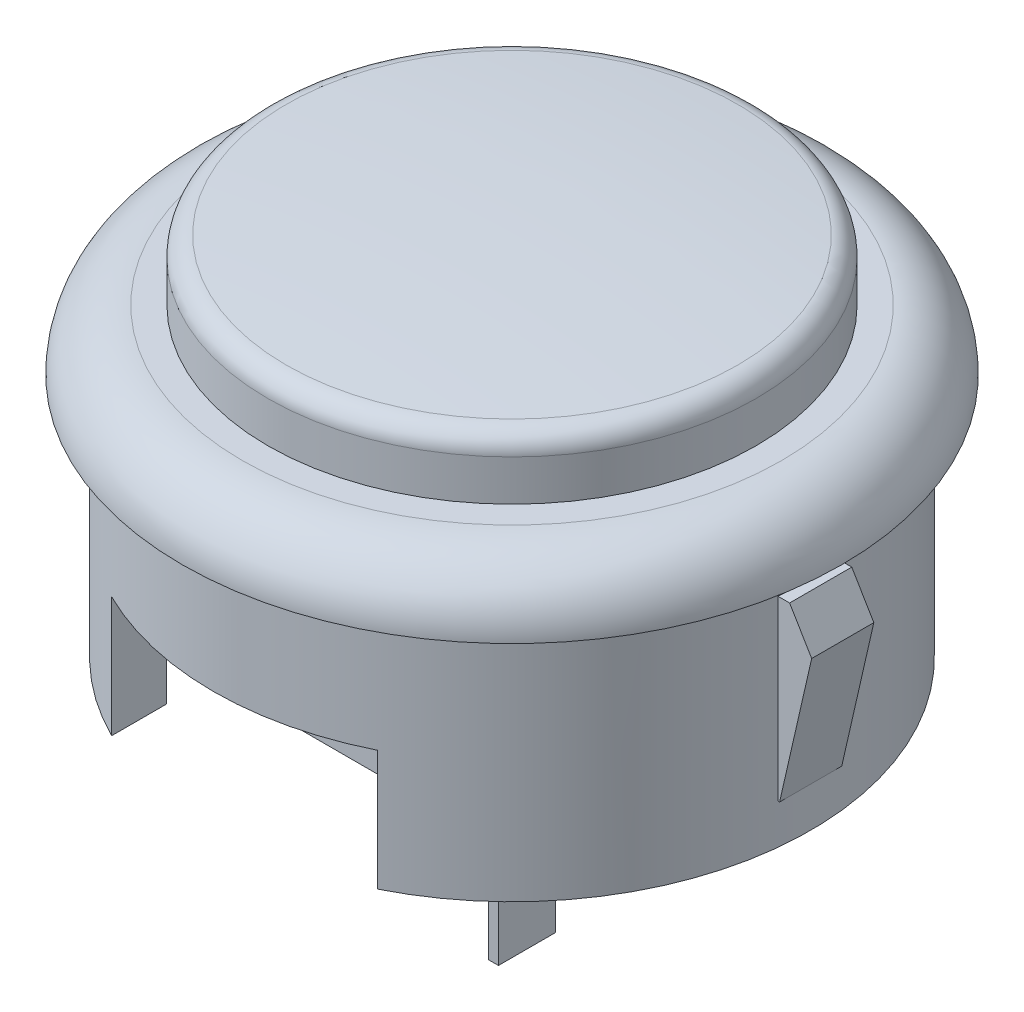
ISO-10303-21;
HEADER;
FILE_DESCRIPTION(('STEP AP214'),'2;1');
FILE_NAME('part.step','',(''),(''),'','','');
FILE_SCHEMA(('AUTOMOTIVE_DESIGN { 1 0 10303 214 1 1 1 1 }'));
ENDSEC;
DATA;
#1=APPLICATION_CONTEXT('core data for automotive mechanical design processes');
#2=APPLICATION_PROTOCOL_DEFINITION('international standard','automotive_design',2000,#1);
#3=PRODUCT_CONTEXT('',#1,'mechanical');
#4=PRODUCT('Part','Part','',(#3));
#5=PRODUCT_RELATED_PRODUCT_CATEGORY('part','',(#4));
#6=PRODUCT_DEFINITION_FORMATION('','',#4);
#7=PRODUCT_DEFINITION_CONTEXT('part definition',#1,'design');
#8=PRODUCT_DEFINITION('design','',#6,#7);
#9=PRODUCT_DEFINITION_SHAPE('','',#8);
#10=(LENGTH_UNIT() NAMED_UNIT(*) SI_UNIT(.MILLI.,.METRE.));
#11=(NAMED_UNIT(*) PLANE_ANGLE_UNIT() SI_UNIT($,.RADIAN.));
#12=(NAMED_UNIT(*) SI_UNIT($,.STERADIAN.) SOLID_ANGLE_UNIT());
#13=UNCERTAINTY_MEASURE_WITH_UNIT(LENGTH_MEASURE(1.E-05),#10,'distance_accuracy_value','');
#14=(GEOMETRIC_REPRESENTATION_CONTEXT(3) GLOBAL_UNCERTAINTY_ASSIGNED_CONTEXT((#13)) GLOBAL_UNIT_ASSIGNED_CONTEXT((#10,
#11,#12)) REPRESENTATION_CONTEXT('',''));
#15=CARTESIAN_POINT('',(0.,0.,0.));
#16=DIRECTION('',(0.,0.,1.));
#17=DIRECTION('',(1.,0.,0.));
#18=AXIS2_PLACEMENT_3D('',#15,#16,#17);
#19=CARTESIAN_POINT('',(0.,-14.25,0.));
#20=DIRECTION('',(0.,1.,0.));
#21=DIRECTION('',(0.,0.,1.));
#22=AXIS2_PLACEMENT_3D('',#19,#20,#21);
#23=PLANE('',#22);
#24=DIRECTION('',(0.,0.,-1.));
#25=VECTOR('',#24,1.);
#26=CARTESIAN_POINT('',(2.2,-14.25,3.375));
#27=LINE('',#26,#25);
#28=CARTESIAN_POINT('',(2.2,-14.25,3.375));
#29=VERTEX_POINT('',#28);
#30=CARTESIAN_POINT('',(2.2,-14.25,0.524999999999999));
#31=VERTEX_POINT('',#30);
#32=EDGE_CURVE('E268',#29,#31,#27,.T.);
#33=ORIENTED_EDGE('',*,*,#32,.F.);
#34=DIRECTION('',(-1.,0.,0.));
#35=VECTOR('',#34,1.);
#36=CARTESIAN_POINT('',(2.2,-14.25,3.375));
#37=LINE('',#36,#35);
#38=CARTESIAN_POINT('',(2.7,-14.25,3.375));
#39=VERTEX_POINT('',#38);
#40=EDGE_CURVE('E281',#39,#29,#37,.T.);
#41=ORIENTED_EDGE('',*,*,#40,.F.);
#42=DIRECTION('',(0.,0.,1.));
#43=VECTOR('',#42,1.);
#44=CARTESIAN_POINT('',(2.7,-14.25,3.375));
#45=LINE('',#44,#43);
#46=CARTESIAN_POINT('',(2.7,-14.25,0.524999999999999));
#47=VERTEX_POINT('',#46);
#48=EDGE_CURVE('E290',#47,#39,#45,.T.);
#49=ORIENTED_EDGE('',*,*,#48,.F.);
#50=DIRECTION('',(1.,0.,0.));
#51=VECTOR('',#50,1.);
#52=CARTESIAN_POINT('',(2.2,-14.25,0.524999999999999));
#53=LINE('',#52,#51);
#54=EDGE_CURVE('E271',#31,#47,#53,.T.);
#55=ORIENTED_EDGE('',*,*,#54,.F.);
#56=EDGE_LOOP('',(#33,#41,#49,#55));
#57=FACE_BOUND('',#56,.T.);
#58=DIRECTION('',(0.,0.,1.));
#59=VECTOR('',#58,1.);
#60=CARTESIAN_POINT('',(6.,-14.25,-6.375));
#61=LINE('',#60,#59);
#62=CARTESIAN_POINT('',(6.,-14.25,-6.375));
#63=VERTEX_POINT('',#62);
#64=CARTESIAN_POINT('',(6.,-14.25,6.375));
#65=VERTEX_POINT('',#64);
#66=EDGE_CURVE('E307',#63,#65,#61,.T.);
#67=ORIENTED_EDGE('',*,*,#66,.T.);
#68=DIRECTION('',(-1.,0.,0.));
#69=VECTOR('',#68,1.);
#70=CARTESIAN_POINT('',(-6.,-14.25,6.375));
#71=LINE('',#70,#69);
#72=CARTESIAN_POINT('',(-6.,-14.25,6.375));
#73=VERTEX_POINT('',#72);
#74=EDGE_CURVE('E310',#65,#73,#71,.T.);
#75=ORIENTED_EDGE('',*,*,#74,.T.);
#76=DIRECTION('',(0.,0.,-1.));
#77=VECTOR('',#76,1.);
#78=CARTESIAN_POINT('',(-6.,-14.25,-6.375));
#79=LINE('',#78,#77);
#80=CARTESIAN_POINT('',(-6.,-14.25,-6.375));
#81=VERTEX_POINT('',#80);
#82=EDGE_CURVE('E313',#73,#81,#79,.T.);
#83=ORIENTED_EDGE('',*,*,#82,.T.);
#84=DIRECTION('',(1.,0.,0.));
#85=VECTOR('',#84,1.);
#86=CARTESIAN_POINT('',(-6.,-14.25,-6.375));
#87=LINE('',#86,#85);
#88=EDGE_CURVE('E315',#81,#63,#87,.T.);
#89=ORIENTED_EDGE('',*,*,#88,.T.);
#90=EDGE_LOOP('',(#67,#75,#83,#89));
#91=FACE_BOUND('',#90,.T.);
#92=DIRECTION('',(0.,0.,-1.));
#93=VECTOR('',#92,1.);
#94=CARTESIAN_POINT('',(-2.7,-14.25,-0.525));
#95=LINE('',#94,#93);
#96=CARTESIAN_POINT('',(-2.7,-14.25,-0.525));
#97=VERTEX_POINT('',#96);
#98=CARTESIAN_POINT('',(-2.7,-14.25,-3.375));
#99=VERTEX_POINT('',#98);
#100=EDGE_CURVE('E267',#97,#99,#95,.T.);
#101=ORIENTED_EDGE('',*,*,#100,.F.);
#102=DIRECTION('',(-1.,0.,0.));
#103=VECTOR('',#102,1.);
#104=CARTESIAN_POINT('',(-2.7,-14.25,-0.525));
#105=LINE('',#104,#103);
#106=CARTESIAN_POINT('',(-2.2,-14.25,-0.525));
#107=VERTEX_POINT('',#106);
#108=EDGE_CURVE('E264',#107,#97,#105,.T.);
#109=ORIENTED_EDGE('',*,*,#108,.F.);
#110=DIRECTION('',(0.,0.,1.));
#111=VECTOR('',#110,1.);
#112=CARTESIAN_POINT('',(-2.2,-14.25,-0.525));
#113=LINE('',#112,#111);
#114=CARTESIAN_POINT('',(-2.2,-14.25,-3.375));
#115=VERTEX_POINT('',#114);
#116=EDGE_CURVE('E63',#115,#107,#113,.T.);
#117=ORIENTED_EDGE('',*,*,#116,.F.);
#118=DIRECTION('',(1.,0.,0.));
#119=VECTOR('',#118,1.);
#120=CARTESIAN_POINT('',(-2.7,-14.25,-3.375));
#121=LINE('',#120,#119);
#122=EDGE_CURVE('E58',#99,#115,#121,.T.);
#123=ORIENTED_EDGE('',*,*,#122,.F.);
#124=EDGE_LOOP('',(#101,#109,#117,#123));
#125=FACE_BOUND('',#124,.T.);
#126=ADVANCED_FACE('F43',(#57,#91,#125),#23,.F.);
#127=CARTESIAN_POINT('',(12.5,-6.25,0.));
#128=DIRECTION('',(0.,1.,0.));
#129=DIRECTION('',(0.,0.,1.));
#130=AXIS2_PLACEMENT_3D('',#127,#128,#129);
#131=PLANE('',#130);
#132=CARTESIAN_POINT('',(0.,-6.25,0.));
#133=DIRECTION('',(0.,1.,0.));
#134=DIRECTION('',(0.,0.,1.));
#135=AXIS2_PLACEMENT_3D('',#132,#133,#134);
#136=CIRCLE('',#135,12.5);
#137=CARTESIAN_POINT('',(6.62499999999999,-6.25,10.5999705188269));
#138=VERTEX_POINT('',#137);
#139=CARTESIAN_POINT('',(6.62499999999999,-6.25,-10.5999705188269));
#140=VERTEX_POINT('',#139);
#141=EDGE_CURVE('E459',#138,#140,#136,.T.);
#142=ORIENTED_EDGE('',*,*,#141,.F.);
#143=DIRECTION('',(0.,0.,1.));
#144=VECTOR('',#143,1.);
#145=CARTESIAN_POINT('',(6.62499999999999,-6.25,-16.45));
#146=LINE('',#145,#144);
#147=CARTESIAN_POINT('',(6.62499999999999,-6.25,13.3461370815678));
#148=VERTEX_POINT('',#147);
#149=EDGE_CURVE('E409',#138,#148,#146,.T.);
#150=ORIENTED_EDGE('',*,*,#149,.T.);
#151=CARTESIAN_POINT('',(0.,-6.25,0.));
#152=DIRECTION('',(0.,1.,0.));
#153=DIRECTION('',(-1.,0.,0.));
#154=AXIS2_PLACEMENT_3D('',#151,#152,#153);
#155=CIRCLE('',#154,14.9);
#156=CARTESIAN_POINT('',(-6.62500000000001,-6.25,13.3461370815678));
#157=VERTEX_POINT('',#156);
#158=EDGE_CURVE('E445',#157,#148,#155,.T.);
#159=ORIENTED_EDGE('',*,*,#158,.F.);
#160=DIRECTION('',(0.,0.,1.));
#161=VECTOR('',#160,1.);
#162=CARTESIAN_POINT('',(-6.62500000000001,-6.25,-16.45));
#163=LINE('',#162,#161);
#164=CARTESIAN_POINT('',(-6.62500000000001,-6.25,10.5999705188269));
#165=VERTEX_POINT('',#164);
#166=EDGE_CURVE('E404',#165,#157,#163,.T.);
#167=ORIENTED_EDGE('',*,*,#166,.F.);
#168=CARTESIAN_POINT('',(-6.62500000000001,-6.25,-10.5999705188269));
#169=VERTEX_POINT('',#168);
#170=EDGE_CURVE('E458',#169,#165,#136,.T.);
#171=ORIENTED_EDGE('',*,*,#170,.F.);
#172=CARTESIAN_POINT('',(-6.62500000000001,-6.25,-13.3461370815678));
#173=VERTEX_POINT('',#172);
#174=EDGE_CURVE('E407',#173,#169,#163,.T.);
#175=ORIENTED_EDGE('',*,*,#174,.F.);
#176=CARTESIAN_POINT('',(6.62499999999999,-6.25,-13.3461370815678));
#177=VERTEX_POINT('',#176);
#178=EDGE_CURVE('E442',#177,#173,#155,.T.);
#179=ORIENTED_EDGE('',*,*,#178,.F.);
#180=EDGE_CURVE('E408',#177,#140,#146,.T.);
#181=ORIENTED_EDGE('',*,*,#180,.T.);
#182=EDGE_LOOP('',(#142,#150,#159,#167,#171,#175,#179,#181));
#183=FACE_BOUND('',#182,.T.);
#184=DIRECTION('',(0.,0.,1.));
#185=VECTOR('',#184,1.);
#186=CARTESIAN_POINT('',(6.,-6.25,-6.375));
#187=LINE('',#186,#185);
#188=CARTESIAN_POINT('',(6.,-6.25,-6.375));
#189=VERTEX_POINT('',#188);
#190=CARTESIAN_POINT('',(6.,-6.25,6.375));
#191=VERTEX_POINT('',#190);
#192=EDGE_CURVE('E306',#189,#191,#187,.T.);
#193=ORIENTED_EDGE('',*,*,#192,.F.);
#194=DIRECTION('',(1.,0.,0.));
#195=VECTOR('',#194,1.);
#196=CARTESIAN_POINT('',(-6.,-6.25,-6.375));
#197=LINE('',#196,#195);
#198=CARTESIAN_POINT('',(-6.,-6.25,-6.375));
#199=VERTEX_POINT('',#198);
#200=EDGE_CURVE('E311',#199,#189,#197,.T.);
#201=ORIENTED_EDGE('',*,*,#200,.F.);
#202=DIRECTION('',(0.,0.,-1.));
#203=VECTOR('',#202,1.);
#204=CARTESIAN_POINT('',(-6.,-6.25,-6.375));
#205=LINE('',#204,#203);
#206=CARTESIAN_POINT('',(-6.,-6.25,6.375));
#207=VERTEX_POINT('',#206);
#208=EDGE_CURVE('E323',#207,#199,#205,.T.);
#209=ORIENTED_EDGE('',*,*,#208,.F.);
#210=DIRECTION('',(-1.,0.,0.));
#211=VECTOR('',#210,1.);
#212=CARTESIAN_POINT('',(-6.,-6.25,6.375));
#213=LINE('',#212,#211);
#214=EDGE_CURVE('E320',#191,#207,#213,.T.);
#215=ORIENTED_EDGE('',*,*,#214,.F.);
#216=EDGE_LOOP('',(#193,#201,#209,#215));
#217=FACE_BOUND('',#216,.T.);
#218=ADVANCED_FACE('F533',(#183,#217),#131,.F.);
#219=CARTESIAN_POINT('',(0.,7.97104395334219,0.));
#220=DIRECTION('',(0.,1.,0.));
#221=DIRECTION('',(0.,0.,1.));
#222=AXIS2_PLACEMENT_3D('',#219,#220,#221);
#223=CYLINDRICAL_SURFACE('',#222,14.9);
#224=DIRECTION('',(0.,1.,0.));
#225=VECTOR('',#224,1.);
#226=CARTESIAN_POINT('',(14.8191598952167,7.97104395334219,1.55));
#227=LINE('',#226,#225);
#228=CARTESIAN_POINT('',(14.8191598952167,-1.4,1.55));
#229=VERTEX_POINT('',#228);
#230=CARTESIAN_POINT('',(14.8191598952167,-10.25,1.55));
#231=VERTEX_POINT('',#230);
#232=EDGE_CURVE('E485',#229,#231,#227,.F.);
#233=ORIENTED_EDGE('',*,*,#232,.F.);
#234=CARTESIAN_POINT('',(0.,-1.4,0.));
#235=DIRECTION('',(0.,-1.,0.));
#236=DIRECTION('',(0.,0.,-1.));
#237=AXIS2_PLACEMENT_3D('',#234,#235,#236);
#238=CIRCLE('',#237,14.9);
#239=CARTESIAN_POINT('',(14.8191598952167,-1.4,-1.55));
#240=VERTEX_POINT('',#239);
#241=EDGE_CURVE('E479',#240,#229,#238,.T.);
#242=ORIENTED_EDGE('',*,*,#241,.F.);
#243=DIRECTION('',(0.,1.,0.));
#244=VECTOR('',#243,1.);
#245=CARTESIAN_POINT('',(14.8191598952167,7.97104395334219,-1.55));
#246=LINE('',#245,#244);
#247=CARTESIAN_POINT('',(14.8191598952167,-10.25,-1.55));
#248=VERTEX_POINT('',#247);
#249=EDGE_CURVE('E476',#240,#248,#246,.F.);
#250=ORIENTED_EDGE('',*,*,#249,.T.);
#251=CARTESIAN_POINT('',(0.,-10.25,0.));
#252=DIRECTION('',(0.,1.,0.));
#253=DIRECTION('',(0.,0.,1.));
#254=AXIS2_PLACEMENT_3D('',#251,#252,#253);
#255=CIRCLE('',#254,14.9);
#256=CARTESIAN_POINT('',(14.9,-10.25,0.));
#257=VERTEX_POINT('',#256);
#258=EDGE_CURVE('E481',#257,#248,#255,.T.);
#259=ORIENTED_EDGE('',*,*,#258,.F.);
#260=EDGE_CURVE('E484',#231,#257,#255,.T.);
#261=ORIENTED_EDGE('',*,*,#260,.F.);
#262=EDGE_LOOP('',(#233,#242,#250,#259,#261));
#263=FACE_BOUND('',#262,.T.);
#264=CARTESIAN_POINT('',(0.,0.,0.));
#265=DIRECTION('',(0.,1.,0.));
#266=DIRECTION('',(0.,0.,1.));
#267=AXIS2_PLACEMENT_3D('',#264,#265,#266);
#268=CIRCLE('',#267,14.9);
#269=CARTESIAN_POINT('',(0.,0.,14.9));
#270=VERTEX_POINT('',#269);
#271=EDGE_CURVE('E470',#270,#270,#268,.T.);
#272=ORIENTED_EDGE('',*,*,#271,.F.);
#273=EDGE_LOOP('',(#272));
#274=FACE_BOUND('',#273,.T.);
#275=ORIENTED_EDGE('',*,*,#178,.T.);
#276=DIRECTION('',(0.,1.,0.));
#277=VECTOR('',#276,1.);
#278=CARTESIAN_POINT('',(-6.62500000000001,7.97104395334219,-13.3461370815678));
#279=LINE('',#278,#277);
#280=CARTESIAN_POINT('',(-6.62500000000001,-12.25,-13.3461370815678));
#281=VERTEX_POINT('',#280);
#282=EDGE_CURVE('E436',#173,#281,#279,.F.);
#283=ORIENTED_EDGE('',*,*,#282,.T.);
#284=CARTESIAN_POINT('',(0.,-12.25,0.));
#285=DIRECTION('',(0.,1.,0.));
#286=DIRECTION('',(0.,0.,1.));
#287=AXIS2_PLACEMENT_3D('',#284,#285,#286);
#288=CIRCLE('',#287,14.9);
#289=CARTESIAN_POINT('',(-6.62500000000001,-12.25,13.3461370815678));
#290=VERTEX_POINT('',#289);
#291=EDGE_CURVE('E466',#281,#290,#288,.T.);
#292=ORIENTED_EDGE('',*,*,#291,.T.);
#293=DIRECTION('',(0.,1.,0.));
#294=VECTOR('',#293,1.);
#295=CARTESIAN_POINT('',(-6.62500000000001,7.97104395334219,13.3461370815678));
#296=LINE('',#295,#294);
#297=EDGE_CURVE('E439',#290,#157,#296,.T.);
#298=ORIENTED_EDGE('',*,*,#297,.T.);
#299=ORIENTED_EDGE('',*,*,#158,.T.);
#300=DIRECTION('',(0.,1.,0.));
#301=VECTOR('',#300,1.);
#302=CARTESIAN_POINT('',(6.62499999999999,7.97104395334219,13.3461370815678));
#303=LINE('',#302,#301);
#304=CARTESIAN_POINT('',(6.62499999999999,-12.25,13.3461370815678));
#305=VERTEX_POINT('',#304);
#306=EDGE_CURVE('E424',#148,#305,#303,.F.);
#307=ORIENTED_EDGE('',*,*,#306,.T.);
#308=CARTESIAN_POINT('',(6.62499999999999,-12.25,-13.3461370815678));
#309=VERTEX_POINT('',#308);
#310=EDGE_CURVE('E467',#305,#309,#288,.T.);
#311=ORIENTED_EDGE('',*,*,#310,.T.);
#312=DIRECTION('',(0.,1.,0.));
#313=VECTOR('',#312,1.);
#314=CARTESIAN_POINT('',(6.62499999999999,7.97104395334219,-13.3461370815678));
#315=LINE('',#314,#313);
#316=EDGE_CURVE('E427',#309,#177,#315,.T.);
#317=ORIENTED_EDGE('',*,*,#316,.T.);
#318=EDGE_LOOP('',(#275,#283,#292,#298,#299,#307,#311,#317));
#319=FACE_BOUND('',#318,.T.);
#320=DIRECTION('',(0.,1.,0.));
#321=VECTOR('',#320,1.);
#322=CARTESIAN_POINT('',(-14.8191598952167,7.97104395334219,1.55));
#323=LINE('',#322,#321);
#324=CARTESIAN_POINT('',(-14.8191598952167,-10.25,1.55));
#325=VERTEX_POINT('',#324);
#326=CARTESIAN_POINT('',(-14.8191598952167,-1.4,1.55));
#327=VERTEX_POINT('',#326);
#328=EDGE_CURVE('E11',#325,#327,#323,.T.);
#329=ORIENTED_EDGE('',*,*,#328,.F.);
#330=CARTESIAN_POINT('',(0.,-10.25,0.));
#331=DIRECTION('',(0.,-1.,0.));
#332=DIRECTION('',(0.,0.,-1.));
#333=AXIS2_PLACEMENT_3D('',#330,#331,#332);
#334=CIRCLE('',#333,14.9);
#335=CARTESIAN_POINT('',(-14.9,-10.25,0.));
#336=VERTEX_POINT('',#335);
#337=EDGE_CURVE('E51',#325,#336,#334,.T.);
#338=ORIENTED_EDGE('',*,*,#337,.T.);
#339=CARTESIAN_POINT('',(-14.8191598952167,-10.25,-1.55));
#340=VERTEX_POINT('',#339);
#341=EDGE_CURVE('E492',#336,#340,#334,.T.);
#342=ORIENTED_EDGE('',*,*,#341,.T.);
#343=DIRECTION('',(0.,1.,0.));
#344=VECTOR('',#343,1.);
#345=CARTESIAN_POINT('',(-14.8191598952167,7.97104395334219,-1.55));
#346=LINE('',#345,#344);
#347=CARTESIAN_POINT('',(-14.8191598952167,-1.4,-1.55));
#348=VERTEX_POINT('',#347);
#349=EDGE_CURVE('E487',#340,#348,#346,.T.);
#350=ORIENTED_EDGE('',*,*,#349,.T.);
#351=CARTESIAN_POINT('',(0.,-1.4,0.));
#352=DIRECTION('',(0.,1.,0.));
#353=DIRECTION('',(0.,0.,1.));
#354=AXIS2_PLACEMENT_3D('',#351,#352,#353);
#355=CIRCLE('',#354,14.9);
#356=EDGE_CURVE('E490',#348,#327,#355,.T.);
#357=ORIENTED_EDGE('',*,*,#356,.T.);
#358=EDGE_LOOP('',(#329,#338,#342,#350,#357));
#359=FACE_BOUND('',#358,.T.);
#360=ADVANCED_FACE('F497',(#263,#274,#319,#359),#223,.T.);
#361=CARTESIAN_POINT('',(14.9,-12.25,0.));
#362=DIRECTION('',(0.,1.,0.));
#363=DIRECTION('',(0.,0.,1.));
#364=AXIS2_PLACEMENT_3D('',#361,#362,#363);
#365=PLANE('',#364);
#366=ORIENTED_EDGE('',*,*,#291,.F.);
#367=DIRECTION('',(0.,0.,1.));
#368=VECTOR('',#367,1.);
#369=CARTESIAN_POINT('',(-6.62500000000001,-12.25,-16.45));
#370=LINE('',#369,#368);
#371=CARTESIAN_POINT('',(-6.62500000000001,-12.25,-10.5999705188269));
#372=VERTEX_POINT('',#371);
#373=EDGE_CURVE('E415',#281,#372,#370,.T.);
#374=ORIENTED_EDGE('',*,*,#373,.T.);
#375=CARTESIAN_POINT('',(0.,-12.25,0.));
#376=DIRECTION('',(0.,1.,0.));
#377=DIRECTION('',(0.,0.,1.));
#378=AXIS2_PLACEMENT_3D('',#375,#376,#377);
#379=CIRCLE('',#378,12.5);
#380=CARTESIAN_POINT('',(-6.62500000000001,-12.25,10.5999705188269));
#381=VERTEX_POINT('',#380);
#382=EDGE_CURVE('E462',#372,#381,#379,.T.);
#383=ORIENTED_EDGE('',*,*,#382,.T.);
#384=EDGE_CURVE('E403',#381,#290,#370,.T.);
#385=ORIENTED_EDGE('',*,*,#384,.T.);
#386=EDGE_LOOP('',(#366,#374,#383,#385));
#387=FACE_BOUND('',#386,.T.);
#388=ADVANCED_FACE('F632',(#387),#365,.F.);
#389=CARTESIAN_POINT('',(0.,7.97104395334219,0.));
#390=DIRECTION('',(0.,1.,0.));
#391=DIRECTION('',(0.,0.,1.));
#392=AXIS2_PLACEMENT_3D('',#389,#390,#391);
#393=CYLINDRICAL_SURFACE('',#392,12.5);
#394=ORIENTED_EDGE('',*,*,#170,.T.);
#395=DIRECTION('',(0.,1.,0.));
#396=VECTOR('',#395,1.);
#397=CARTESIAN_POINT('',(-6.62500000000001,7.97104395334219,10.5999705188269));
#398=LINE('',#397,#396);
#399=EDGE_CURVE('E433',#165,#381,#398,.F.);
#400=ORIENTED_EDGE('',*,*,#399,.T.);
#401=ORIENTED_EDGE('',*,*,#382,.F.);
#402=DIRECTION('',(0.,1.,0.));
#403=VECTOR('',#402,1.);
#404=CARTESIAN_POINT('',(-6.62500000000001,7.97104395334219,-10.5999705188269));
#405=LINE('',#404,#403);
#406=EDGE_CURVE('E430',#372,#169,#405,.T.);
#407=ORIENTED_EDGE('',*,*,#406,.T.);
#408=EDGE_LOOP('',(#394,#400,#401,#407));
#409=FACE_BOUND('',#408,.T.);
#410=ADVANCED_FACE('F627',(#409),#393,.F.);
#411=CARTESIAN_POINT('',(0.,0.,0.));
#412=DIRECTION('',(0.,1.,0.));
#413=DIRECTION('',(0.,0.,1.));
#414=AXIS2_PLACEMENT_3D('',#411,#412,#413);
#415=TOROIDAL_SURFACE('',#414,13.45,3.);
#416=CARTESIAN_POINT('',(0.,3.,0.));
#417=DIRECTION('',(0.,1.,0.));
#418=DIRECTION('',(0.,0.,1.));
#419=AXIS2_PLACEMENT_3D('',#416,#417,#418);
#420=CIRCLE('',#419,13.45);
#421=CARTESIAN_POINT('',(0.,3.,13.45));
#422=VERTEX_POINT('',#421);
#423=EDGE_CURVE('E446',#422,#422,#420,.T.);
#424=ORIENTED_EDGE('',*,*,#423,.F.);
#425=EDGE_LOOP('',(#424));
#426=FACE_BOUND('',#425,.T.);
#427=CARTESIAN_POINT('',(0.,0.,0.));
#428=DIRECTION('',(0.,1.,0.));
#429=DIRECTION('',(0.,0.,1.));
#430=AXIS2_PLACEMENT_3D('',#427,#428,#429);
#431=CIRCLE('',#430,16.45);
#432=CARTESIAN_POINT('',(0.,0.,16.45));
#433=VERTEX_POINT('',#432);
#434=EDGE_CURVE('E473',#433,#433,#431,.T.);
#435=ORIENTED_EDGE('',*,*,#434,.T.);
#436=EDGE_LOOP('',(#435));
#437=FACE_BOUND('',#436,.T.);
#438=ADVANCED_FACE('F45',(#426,#437),#415,.T.);
#439=CARTESIAN_POINT('',(16.45,0.,0.));
#440=DIRECTION('',(0.,1.,0.));
#441=DIRECTION('',(0.,0.,1.));
#442=AXIS2_PLACEMENT_3D('',#439,#440,#441);
#443=PLANE('',#442);
#444=ORIENTED_EDGE('',*,*,#434,.F.);
#445=EDGE_LOOP('',(#444));
#446=FACE_BOUND('',#445,.T.);
#447=ORIENTED_EDGE('',*,*,#271,.T.);
#448=EDGE_LOOP('',(#447));
#449=FACE_BOUND('',#448,.T.);
#450=ADVANCED_FACE('F630',(#446,#449),#443,.F.);
#451=ORIENTED_EDGE('',*,*,#310,.F.);
#452=DIRECTION('',(0.,0.,1.));
#453=VECTOR('',#452,1.);
#454=CARTESIAN_POINT('',(6.62499999999999,-12.25,-16.45));
#455=LINE('',#454,#453);
#456=CARTESIAN_POINT('',(6.62499999999999,-12.25,10.5999705188269));
#457=VERTEX_POINT('',#456);
#458=EDGE_CURVE('E413',#457,#305,#455,.T.);
#459=ORIENTED_EDGE('',*,*,#458,.F.);
#460=CARTESIAN_POINT('',(6.62499999999999,-12.25,-10.5999705188269));
#461=VERTEX_POINT('',#460);
#462=EDGE_CURVE('E463',#457,#461,#379,.T.);
#463=ORIENTED_EDGE('',*,*,#462,.T.);
#464=EDGE_CURVE('E412',#309,#461,#455,.T.);
#465=ORIENTED_EDGE('',*,*,#464,.F.);
#466=EDGE_LOOP('',(#451,#459,#463,#465));
#467=FACE_BOUND('',#466,.T.);
#468=ADVANCED_FACE('F625',(#467),#365,.F.);
#469=ORIENTED_EDGE('',*,*,#141,.T.);
#470=DIRECTION('',(0.,1.,0.));
#471=VECTOR('',#470,1.);
#472=CARTESIAN_POINT('',(6.62499999999999,7.97104395334219,-10.5999705188269));
#473=LINE('',#472,#471);
#474=EDGE_CURVE('E421',#140,#461,#473,.F.);
#475=ORIENTED_EDGE('',*,*,#474,.T.);
#476=ORIENTED_EDGE('',*,*,#462,.F.);
#477=DIRECTION('',(0.,1.,0.));
#478=VECTOR('',#477,1.);
#479=CARTESIAN_POINT('',(6.62499999999999,7.97104395334219,10.5999705188269));
#480=LINE('',#479,#478);
#481=EDGE_CURVE('E418',#457,#138,#480,.T.);
#482=ORIENTED_EDGE('',*,*,#481,.T.);
#483=EDGE_LOOP('',(#469,#475,#476,#482));
#484=FACE_BOUND('',#483,.T.);
#485=ADVANCED_FACE('F620',(#484),#393,.F.);
#486=CARTESIAN_POINT('',(0.,-117.275520833333,0.));
#487=DIRECTION('',(0.,1.,0.));
#488=DIRECTION('',(1.,0.,0.));
#489=AXIS2_PLACEMENT_3D('',#486,#487,#488);
#490=SPHERICAL_SURFACE('',#489,123.825520833333);
#491=CARTESIAN_POINT('',(0.,6.03643010003557,0.));
#492=DIRECTION('',(0.,1.,0.));
#493=DIRECTION('',(0.,0.,1.));
#494=AXIS2_PLACEMENT_3D('',#491,#492,#493);
#495=CIRCLE('',#494,11.2659827202375);
#496=CARTESIAN_POINT('',(0.,6.03643010003557,11.2659827202375));
#497=VERTEX_POINT('',#496);
#498=EDGE_CURVE('E455',#497,#497,#495,.T.);
#499=ORIENTED_EDGE('',*,*,#498,.T.);
#500=EDGE_LOOP('',(#499));
#501=FACE_BOUND('',#500,.T.);
#502=ADVANCED_FACE('F617',(#501),#490,.T.);
#503=CARTESIAN_POINT('',(0.,5.04057762872356,0.));
#504=DIRECTION('',(0.,1.,0.));
#505=DIRECTION('',(0.,0.,1.));
#506=AXIS2_PLACEMENT_3D('',#503,#504,#505);
#507=TOROIDAL_SURFACE('',#506,11.175,1.00000000000001);
#508=ORIENTED_EDGE('',*,*,#498,.F.);
#509=EDGE_LOOP('',(#508));
#510=FACE_BOUND('',#509,.T.);
#511=CARTESIAN_POINT('',(0.,5.04057762872356,0.));
#512=DIRECTION('',(0.,1.,0.));
#513=DIRECTION('',(0.,0.,1.));
#514=AXIS2_PLACEMENT_3D('',#511,#512,#513);
#515=CIRCLE('',#514,12.175);
#516=CARTESIAN_POINT('',(0.,5.04057762872356,12.175));
#517=VERTEX_POINT('',#516);
#518=EDGE_CURVE('E452',#517,#517,#515,.T.);
#519=ORIENTED_EDGE('',*,*,#518,.T.);
#520=EDGE_LOOP('',(#519));
#521=FACE_BOUND('',#520,.T.);
#522=ADVANCED_FACE('F613',(#510,#521),#507,.T.);
#523=CARTESIAN_POINT('',(0.,7.97104395334219,0.));
#524=DIRECTION('',(0.,1.,0.));
#525=DIRECTION('',(0.,0.,1.));
#526=AXIS2_PLACEMENT_3D('',#523,#524,#525);
#527=CYLINDRICAL_SURFACE('',#526,12.175);
#528=ORIENTED_EDGE('',*,*,#518,.F.);
#529=EDGE_LOOP('',(#528));
#530=FACE_BOUND('',#529,.T.);
#531=CARTESIAN_POINT('',(0.,3.,0.));
#532=DIRECTION('',(0.,1.,0.));
#533=DIRECTION('',(0.,0.,1.));
#534=AXIS2_PLACEMENT_3D('',#531,#532,#533);
#535=CIRCLE('',#534,12.175);
#536=CARTESIAN_POINT('',(0.,3.,12.175));
#537=VERTEX_POINT('',#536);
#538=EDGE_CURVE('E449',#537,#537,#535,.T.);
#539=ORIENTED_EDGE('',*,*,#538,.T.);
#540=EDGE_LOOP('',(#539));
#541=FACE_BOUND('',#540,.T.);
#542=ADVANCED_FACE('F609',(#530,#541),#527,.T.);
#543=CARTESIAN_POINT('',(12.175,3.,0.));
#544=DIRECTION('',(0.,-1.,0.));
#545=DIRECTION('',(0.,0.,-1.));
#546=AXIS2_PLACEMENT_3D('',#543,#544,#545);
#547=PLANE('',#546);
#548=ORIENTED_EDGE('',*,*,#538,.F.);
#549=EDGE_LOOP('',(#548));
#550=FACE_BOUND('',#549,.T.);
#551=ORIENTED_EDGE('',*,*,#423,.T.);
#552=EDGE_LOOP('',(#551));
#553=FACE_BOUND('',#552,.T.);
#554=ADVANCED_FACE('F606',(#550,#553),#547,.F.);
#555=CARTESIAN_POINT('',(6.62499999999999,-6.25,-16.45));
#556=DIRECTION('',(1.,0.,0.));
#557=DIRECTION('',(0.,1.,0.));
#558=AXIS2_PLACEMENT_3D('',#555,#556,#557);
#559=PLANE('',#558);
#560=ORIENTED_EDGE('',*,*,#149,.F.);
#561=ORIENTED_EDGE('',*,*,#481,.F.);
#562=ORIENTED_EDGE('',*,*,#458,.T.);
#563=ORIENTED_EDGE('',*,*,#306,.F.);
#564=EDGE_LOOP('',(#560,#561,#562,#563));
#565=FACE_BOUND('',#564,.T.);
#566=ADVANCED_FACE('F601',(#565),#559,.F.);
#567=CARTESIAN_POINT('',(-6.62500000000001,-6.25,-16.45));
#568=DIRECTION('',(-1.,0.,0.));
#569=DIRECTION('',(0.,0.,1.));
#570=AXIS2_PLACEMENT_3D('',#567,#568,#569);
#571=PLANE('',#570);
#572=ORIENTED_EDGE('',*,*,#384,.F.);
#573=ORIENTED_EDGE('',*,*,#399,.F.);
#574=ORIENTED_EDGE('',*,*,#166,.T.);
#575=ORIENTED_EDGE('',*,*,#297,.F.);
#576=EDGE_LOOP('',(#572,#573,#574,#575));
#577=FACE_BOUND('',#576,.T.);
#578=ADVANCED_FACE('F602',(#577),#571,.F.);
#579=ORIENTED_EDGE('',*,*,#174,.T.);
#580=ORIENTED_EDGE('',*,*,#406,.F.);
#581=ORIENTED_EDGE('',*,*,#373,.F.);
#582=ORIENTED_EDGE('',*,*,#282,.F.);
#583=EDGE_LOOP('',(#579,#580,#581,#582));
#584=FACE_BOUND('',#583,.T.);
#585=ADVANCED_FACE('F599',(#584),#571,.F.);
#586=ORIENTED_EDGE('',*,*,#464,.T.);
#587=ORIENTED_EDGE('',*,*,#474,.F.);
#588=ORIENTED_EDGE('',*,*,#180,.F.);
#589=ORIENTED_EDGE('',*,*,#316,.F.);
#590=EDGE_LOOP('',(#586,#587,#588,#589));
#591=FACE_BOUND('',#590,.T.);
#592=ADVANCED_FACE('F596',(#591),#559,.F.);
#593=CARTESIAN_POINT('',(14.9,-10.25,1.55));
#594=DIRECTION('',(0.,1.,0.));
#595=DIRECTION('',(0.,0.,1.));
#596=AXIS2_PLACEMENT_3D('',#593,#594,#595);
#597=PLANE('',#596);
#598=DIRECTION('',(1.,0.,0.));
#599=VECTOR('',#598,1.);
#600=CARTESIAN_POINT('',(14.9,-10.25,1.55));
#601=LINE('',#600,#599);
#602=CARTESIAN_POINT('',(14.9,-10.25,1.55));
#603=VERTEX_POINT('',#602);
#604=EDGE_CURVE('E370',#231,#603,#601,.T.);
#605=ORIENTED_EDGE('',*,*,#604,.F.);
#606=ORIENTED_EDGE('',*,*,#260,.T.);
#607=DIRECTION('',(0.,0.,-1.));
#608=VECTOR('',#607,1.);
#609=CARTESIAN_POINT('',(14.9,-10.25,1.55));
#610=LINE('',#609,#608);
#611=EDGE_CURVE('E400',#603,#257,#610,.T.);
#612=ORIENTED_EDGE('',*,*,#611,.F.);
#613=EDGE_LOOP('',(#605,#606,#612));
#614=FACE_BOUND('',#613,.T.);
#615=ADVANCED_FACE('F595',(#614),#597,.F.);
#616=CARTESIAN_POINT('',(0.,0.,1.55));
#617=DIRECTION('',(0.,0.,-1.));
#618=DIRECTION('',(-1.,0.,0.));
#619=AXIS2_PLACEMENT_3D('',#616,#617,#618);
#620=PLANE('',#619);
#621=DIRECTION('',(-1.,0.,0.));
#622=VECTOR('',#621,1.);
#623=CARTESIAN_POINT('',(15.4,-1.4,1.55));
#624=LINE('',#623,#622);
#625=CARTESIAN_POINT('',(15.4,-1.4,1.55));
#626=VERTEX_POINT('',#625);
#627=EDGE_CURVE('E379',#626,#229,#624,.T.);
#628=ORIENTED_EDGE('',*,*,#627,.T.);
#629=ORIENTED_EDGE('',*,*,#232,.T.);
#630=ORIENTED_EDGE('',*,*,#604,.T.);
#631=DIRECTION('',(0.222824801502141,0.974858506571867,0.));
#632=VECTOR('',#631,1.);
#633=CARTESIAN_POINT('',(14.9,-10.25,1.55));
#634=LINE('',#633,#632);
#635=CARTESIAN_POINT('',(16.5,-3.25,1.55));
#636=VERTEX_POINT('',#635);
#637=EDGE_CURVE('E372',#603,#636,#634,.T.);
#638=ORIENTED_EDGE('',*,*,#637,.T.);
#639=DIRECTION('',(-0.511075392877149,0.859535888020662,0.));
#640=VECTOR('',#639,1.);
#641=CARTESIAN_POINT('',(16.5,-3.25,1.55));
#642=LINE('',#641,#640);
#643=EDGE_CURVE('E376',#636,#626,#642,.T.);
#644=ORIENTED_EDGE('',*,*,#643,.T.);
#645=EDGE_LOOP('',(#628,#629,#630,#638,#644));
#646=FACE_BOUND('',#645,.T.);
#647=ADVANCED_FACE('F684',(#646),#620,.F.);
#648=CARTESIAN_POINT('',(0.,0.,-1.55));
#649=DIRECTION('',(0.,0.,-1.));
#650=DIRECTION('',(-1.,0.,0.));
#651=AXIS2_PLACEMENT_3D('',#648,#649,#650);
#652=PLANE('',#651);
#653=ORIENTED_EDGE('',*,*,#249,.F.);
#654=DIRECTION('',(-1.,0.,0.));
#655=VECTOR('',#654,1.);
#656=CARTESIAN_POINT('',(15.4,-1.4,-1.55));
#657=LINE('',#656,#655);
#658=CARTESIAN_POINT('',(15.4,-1.4,-1.55));
#659=VERTEX_POINT('',#658);
#660=EDGE_CURVE('E373',#659,#240,#657,.T.);
#661=ORIENTED_EDGE('',*,*,#660,.F.);
#662=DIRECTION('',(-0.511075392877149,0.859535888020662,0.));
#663=VECTOR('',#662,1.);
#664=CARTESIAN_POINT('',(16.5,-3.25,-1.55));
#665=LINE('',#664,#663);
#666=CARTESIAN_POINT('',(16.5,-3.25,-1.55));
#667=VERTEX_POINT('',#666);
#668=EDGE_CURVE('E388',#667,#659,#665,.T.);
#669=ORIENTED_EDGE('',*,*,#668,.F.);
#670=DIRECTION('',(0.222824801502141,0.974858506571867,0.));
#671=VECTOR('',#670,1.);
#672=CARTESIAN_POINT('',(14.9,-10.25,-1.55));
#673=LINE('',#672,#671);
#674=CARTESIAN_POINT('',(14.9,-10.25,-1.55));
#675=VERTEX_POINT('',#674);
#676=EDGE_CURVE('E385',#675,#667,#673,.T.);
#677=ORIENTED_EDGE('',*,*,#676,.F.);
#678=DIRECTION('',(1.,0.,0.));
#679=VECTOR('',#678,1.);
#680=CARTESIAN_POINT('',(14.9,-10.25,-1.55));
#681=LINE('',#680,#679);
#682=EDGE_CURVE('E369',#248,#675,#681,.T.);
#683=ORIENTED_EDGE('',*,*,#682,.F.);
#684=EDGE_LOOP('',(#653,#661,#669,#677,#683));
#685=FACE_BOUND('',#684,.T.);
#686=ADVANCED_FACE('F586',(#685),#652,.T.);
#687=EDGE_CURVE('E399',#257,#675,#610,.T.);
#688=ORIENTED_EDGE('',*,*,#687,.F.);
#689=ORIENTED_EDGE('',*,*,#258,.T.);
#690=ORIENTED_EDGE('',*,*,#682,.T.);
#691=EDGE_LOOP('',(#688,#689,#690));
#692=FACE_BOUND('',#691,.T.);
#693=ADVANCED_FACE('F590',(#692),#597,.F.);
#694=CARTESIAN_POINT('',(14.9,-10.25,1.55));
#695=DIRECTION('',(-0.974858506571867,0.222824801502141,0.));
#696=DIRECTION('',(-0.222824801502141,-0.974858506571868,0.));
#697=AXIS2_PLACEMENT_3D('',#694,#695,#696);
#698=PLANE('',#697);
#699=ORIENTED_EDGE('',*,*,#676,.T.);
#700=DIRECTION('',(0.,0.,-1.));
#701=VECTOR('',#700,1.);
#702=CARTESIAN_POINT('',(16.5,-3.25,1.55));
#703=LINE('',#702,#701);
#704=EDGE_CURVE('E395',#636,#667,#703,.T.);
#705=ORIENTED_EDGE('',*,*,#704,.F.);
#706=ORIENTED_EDGE('',*,*,#637,.F.);
#707=ORIENTED_EDGE('',*,*,#611,.T.);
#708=ORIENTED_EDGE('',*,*,#687,.T.);
#709=EDGE_LOOP('',(#699,#705,#706,#707,#708));
#710=FACE_BOUND('',#709,.T.);
#711=ADVANCED_FACE('F582',(#710),#698,.F.);
#712=CARTESIAN_POINT('',(16.5,-3.25,1.55));
#713=DIRECTION('',(-0.859535888020662,-0.511075392877149,0.));
#714=DIRECTION('',(0.511075392877149,-0.859535888020662,0.));
#715=AXIS2_PLACEMENT_3D('',#712,#713,#714);
#716=PLANE('',#715);
#717=ORIENTED_EDGE('',*,*,#668,.T.);
#718=DIRECTION('',(0.,0.,-1.));
#719=VECTOR('',#718,1.);
#720=CARTESIAN_POINT('',(15.4,-1.4,1.55));
#721=LINE('',#720,#719);
#722=EDGE_CURVE('E382',#626,#659,#721,.T.);
#723=ORIENTED_EDGE('',*,*,#722,.F.);
#724=ORIENTED_EDGE('',*,*,#643,.F.);
#725=ORIENTED_EDGE('',*,*,#704,.T.);
#726=EDGE_LOOP('',(#717,#723,#724,#725));
#727=FACE_BOUND('',#726,.T.);
#728=ADVANCED_FACE('F576',(#727),#716,.F.);
#729=CARTESIAN_POINT('',(15.4,-1.4,1.55));
#730=DIRECTION('',(0.,-1.,0.));
#731=DIRECTION('',(0.,0.,-1.));
#732=AXIS2_PLACEMENT_3D('',#729,#730,#731);
#733=PLANE('',#732);
#734=ORIENTED_EDGE('',*,*,#660,.T.);
#735=ORIENTED_EDGE('',*,*,#241,.T.);
#736=ORIENTED_EDGE('',*,*,#627,.F.);
#737=ORIENTED_EDGE('',*,*,#722,.T.);
#738=EDGE_LOOP('',(#734,#735,#736,#737));
#739=FACE_BOUND('',#738,.T.);
#740=ADVANCED_FACE('F572',(#739),#733,.F.);
#741=CARTESIAN_POINT('',(-14.9,-10.25,1.55));
#742=DIRECTION('',(0.,-1.,0.));
#743=DIRECTION('',(0.,0.,-1.));
#744=AXIS2_PLACEMENT_3D('',#741,#742,#743);
#745=PLANE('',#744);
#746=ORIENTED_EDGE('',*,*,#337,.F.);
#747=DIRECTION('',(-1.,0.,0.));
#748=VECTOR('',#747,1.);
#749=CARTESIAN_POINT('',(-14.9,-10.25,1.55));
#750=LINE('',#749,#748);
#751=CARTESIAN_POINT('',(-14.9,-10.25,1.55));
#752=VERTEX_POINT('',#751);
#753=EDGE_CURVE('E340',#325,#752,#750,.T.);
#754=ORIENTED_EDGE('',*,*,#753,.T.);
#755=DIRECTION('',(0.,0.,-1.));
#756=VECTOR('',#755,1.);
#757=CARTESIAN_POINT('',(-14.9,-10.25,1.55));
#758=LINE('',#757,#756);
#759=EDGE_CURVE('E362',#752,#336,#758,.T.);
#760=ORIENTED_EDGE('',*,*,#759,.T.);
#761=EDGE_LOOP('',(#746,#754,#760));
#762=FACE_BOUND('',#761,.T.);
#763=ADVANCED_FACE('F500',(#762),#745,.T.);
#764=CARTESIAN_POINT('',(0.,0.,1.55));
#765=DIRECTION('',(0.,0.,-1.));
#766=DIRECTION('',(1.,0.,0.));
#767=AXIS2_PLACEMENT_3D('',#764,#765,#766);
#768=PLANE('',#767);
#769=ORIENTED_EDGE('',*,*,#753,.F.);
#770=ORIENTED_EDGE('',*,*,#328,.T.);
#771=DIRECTION('',(1.,0.,0.));
#772=VECTOR('',#771,1.);
#773=CARTESIAN_POINT('',(-15.4,-1.4,1.55));
#774=LINE('',#773,#772);
#775=CARTESIAN_POINT('',(-15.4,-1.4,1.55));
#776=VERTEX_POINT('',#775);
#777=EDGE_CURVE('E342',#776,#327,#774,.T.);
#778=ORIENTED_EDGE('',*,*,#777,.F.);
#779=DIRECTION('',(0.511075392877149,0.859535888020662,0.));
#780=VECTOR('',#779,1.);
#781=CARTESIAN_POINT('',(-16.5,-3.25,1.55));
#782=LINE('',#781,#780);
#783=CARTESIAN_POINT('',(-16.5,-3.25,1.55));
#784=VERTEX_POINT('',#783);
#785=EDGE_CURVE('E346',#784,#776,#782,.T.);
#786=ORIENTED_EDGE('',*,*,#785,.F.);
#787=DIRECTION('',(-0.222824801502141,0.974858506571867,0.));
#788=VECTOR('',#787,1.);
#789=CARTESIAN_POINT('',(-14.9,-10.25,1.55));
#790=LINE('',#789,#788);
#791=EDGE_CURVE('E349',#752,#784,#790,.T.);
#792=ORIENTED_EDGE('',*,*,#791,.F.);
#793=EDGE_LOOP('',(#769,#770,#778,#786,#792));
#794=FACE_BOUND('',#793,.T.);
#795=ADVANCED_FACE('F504',(#794),#768,.F.);
#796=CARTESIAN_POINT('',(0.,0.,-1.55));
#797=DIRECTION('',(0.,0.,-1.));
#798=DIRECTION('',(1.,0.,0.));
#799=AXIS2_PLACEMENT_3D('',#796,#797,#798);
#800=PLANE('',#799);
#801=ORIENTED_EDGE('',*,*,#349,.F.);
#802=DIRECTION('',(-1.,0.,0.));
#803=VECTOR('',#802,1.);
#804=CARTESIAN_POINT('',(-14.9,-10.25,-1.55));
#805=LINE('',#804,#803);
#806=CARTESIAN_POINT('',(-14.9,-10.25,-1.55));
#807=VERTEX_POINT('',#806);
#808=EDGE_CURVE('E339',#340,#807,#805,.T.);
#809=ORIENTED_EDGE('',*,*,#808,.T.);
#810=DIRECTION('',(-0.222824801502141,0.974858506571867,0.));
#811=VECTOR('',#810,1.);
#812=CARTESIAN_POINT('',(-14.9,-10.25,-1.55));
#813=LINE('',#812,#811);
#814=CARTESIAN_POINT('',(-16.5,-3.25,-1.55));
#815=VERTEX_POINT('',#814);
#816=EDGE_CURVE('E343',#807,#815,#813,.T.);
#817=ORIENTED_EDGE('',*,*,#816,.T.);
#818=DIRECTION('',(0.511075392877149,0.859535888020662,0.));
#819=VECTOR('',#818,1.);
#820=CARTESIAN_POINT('',(-16.5,-3.25,-1.55));
#821=LINE('',#820,#819);
#822=CARTESIAN_POINT('',(-15.4,-1.4,-1.55));
#823=VERTEX_POINT('',#822);
#824=EDGE_CURVE('E357',#815,#823,#821,.T.);
#825=ORIENTED_EDGE('',*,*,#824,.T.);
#826=DIRECTION('',(1.,0.,0.));
#827=VECTOR('',#826,1.);
#828=CARTESIAN_POINT('',(-15.4,-1.4,-1.55));
#829=LINE('',#828,#827);
#830=EDGE_CURVE('E355',#823,#348,#829,.T.);
#831=ORIENTED_EDGE('',*,*,#830,.T.);
#832=EDGE_LOOP('',(#801,#809,#817,#825,#831));
#833=FACE_BOUND('',#832,.T.);
#834=ADVANCED_FACE('F516',(#833),#800,.T.);
#835=ORIENTED_EDGE('',*,*,#341,.F.);
#836=EDGE_CURVE('E352',#336,#807,#758,.T.);
#837=ORIENTED_EDGE('',*,*,#836,.T.);
#838=ORIENTED_EDGE('',*,*,#808,.F.);
#839=EDGE_LOOP('',(#835,#837,#838));
#840=FACE_BOUND('',#839,.T.);
#841=ADVANCED_FACE('F514',(#840),#745,.T.);
#842=CARTESIAN_POINT('',(-15.4,-1.4,1.55));
#843=DIRECTION('',(0.,1.,0.));
#844=DIRECTION('',(0.,0.,1.));
#845=AXIS2_PLACEMENT_3D('',#842,#843,#844);
#846=PLANE('',#845);
#847=ORIENTED_EDGE('',*,*,#356,.F.);
#848=ORIENTED_EDGE('',*,*,#830,.F.);
#849=DIRECTION('',(0.,0.,-1.));
#850=VECTOR('',#849,1.);
#851=CARTESIAN_POINT('',(-15.4,-1.4,1.55));
#852=LINE('',#851,#850);
#853=EDGE_CURVE('E367',#776,#823,#852,.T.);
#854=ORIENTED_EDGE('',*,*,#853,.F.);
#855=ORIENTED_EDGE('',*,*,#777,.T.);
#856=EDGE_LOOP('',(#847,#848,#854,#855));
#857=FACE_BOUND('',#856,.T.);
#858=ADVANCED_FACE('F520',(#857),#846,.T.);
#859=CARTESIAN_POINT('',(-16.5,-3.25,1.55));
#860=DIRECTION('',(-0.859535888020662,0.511075392877149,0.));
#861=DIRECTION('',(-0.511075392877149,-0.859535888020662,0.));
#862=AXIS2_PLACEMENT_3D('',#859,#860,#861);
#863=PLANE('',#862);
#864=ORIENTED_EDGE('',*,*,#824,.F.);
#865=DIRECTION('',(0.,0.,-1.));
#866=VECTOR('',#865,1.);
#867=CARTESIAN_POINT('',(-16.5,-3.25,1.55));
#868=LINE('',#867,#866);
#869=EDGE_CURVE('E365',#784,#815,#868,.T.);
#870=ORIENTED_EDGE('',*,*,#869,.F.);
#871=ORIENTED_EDGE('',*,*,#785,.T.);
#872=ORIENTED_EDGE('',*,*,#853,.T.);
#873=EDGE_LOOP('',(#864,#870,#871,#872));
#874=FACE_BOUND('',#873,.T.);
#875=ADVANCED_FACE('F522',(#874),#863,.T.);
#876=CARTESIAN_POINT('',(-14.9,-10.25,1.55));
#877=DIRECTION('',(-0.974858506571867,-0.222824801502141,0.));
#878=DIRECTION('',(0.222824801502141,-0.974858506571868,0.));
#879=AXIS2_PLACEMENT_3D('',#876,#877,#878);
#880=PLANE('',#879);
#881=ORIENTED_EDGE('',*,*,#816,.F.);
#882=ORIENTED_EDGE('',*,*,#836,.F.);
#883=ORIENTED_EDGE('',*,*,#759,.F.);
#884=ORIENTED_EDGE('',*,*,#791,.T.);
#885=ORIENTED_EDGE('',*,*,#869,.T.);
#886=EDGE_LOOP('',(#881,#882,#883,#884,#885));
#887=FACE_BOUND('',#886,.T.);
#888=ADVANCED_FACE('F509',(#887),#880,.T.);
#889=CARTESIAN_POINT('',(6.,-14.25,-6.375));
#890=DIRECTION('',(-1.,0.,0.));
#891=DIRECTION('',(0.,0.,1.));
#892=AXIS2_PLACEMENT_3D('',#889,#890,#891);
#893=PLANE('',#892);
#894=ORIENTED_EDGE('',*,*,#192,.T.);
#895=DIRECTION('',(0.,1.,0.));
#896=VECTOR('',#895,1.);
#897=CARTESIAN_POINT('',(6.,-14.25,6.375));
#898=LINE('',#897,#896);
#899=EDGE_CURVE('E336',#65,#191,#898,.T.);
#900=ORIENTED_EDGE('',*,*,#899,.F.);
#901=ORIENTED_EDGE('',*,*,#66,.F.);
#902=DIRECTION('',(0.,1.,0.));
#903=VECTOR('',#902,1.);
#904=CARTESIAN_POINT('',(6.,-14.25,-6.375));
#905=LINE('',#904,#903);
#906=EDGE_CURVE('E317',#63,#189,#905,.T.);
#907=ORIENTED_EDGE('',*,*,#906,.T.);
#908=EDGE_LOOP('',(#894,#900,#901,#907));
#909=FACE_BOUND('',#908,.T.);
#910=ADVANCED_FACE('F529',(#909),#893,.F.);
#911=CARTESIAN_POINT('',(-6.,-14.25,6.375));
#912=DIRECTION('',(0.,0.,-1.));
#913=DIRECTION('',(-1.,0.,0.));
#914=AXIS2_PLACEMENT_3D('',#911,#912,#913);
#915=PLANE('',#914);
#916=ORIENTED_EDGE('',*,*,#214,.T.);
#917=DIRECTION('',(0.,1.,0.));
#918=VECTOR('',#917,1.);
#919=CARTESIAN_POINT('',(-6.,-14.25,6.375));
#920=LINE('',#919,#918);
#921=EDGE_CURVE('E333',#73,#207,#920,.T.);
#922=ORIENTED_EDGE('',*,*,#921,.F.);
#923=ORIENTED_EDGE('',*,*,#74,.F.);
#924=ORIENTED_EDGE('',*,*,#899,.T.);
#925=EDGE_LOOP('',(#916,#922,#923,#924));
#926=FACE_BOUND('',#925,.T.);
#927=ADVANCED_FACE('F553',(#926),#915,.F.);
#928=CARTESIAN_POINT('',(-6.,-14.25,-6.375));
#929=DIRECTION('',(1.,0.,0.));
#930=DIRECTION('',(0.,0.,-1.));
#931=AXIS2_PLACEMENT_3D('',#928,#929,#930);
#932=PLANE('',#931);
#933=ORIENTED_EDGE('',*,*,#208,.T.);
#934=DIRECTION('',(0.,1.,0.));
#935=VECTOR('',#934,1.);
#936=CARTESIAN_POINT('',(-6.,-14.25,-6.375));
#937=LINE('',#936,#935);
#938=EDGE_CURVE('E330',#81,#199,#937,.T.);
#939=ORIENTED_EDGE('',*,*,#938,.F.);
#940=ORIENTED_EDGE('',*,*,#82,.F.);
#941=ORIENTED_EDGE('',*,*,#921,.T.);
#942=EDGE_LOOP('',(#933,#939,#940,#941));
#943=FACE_BOUND('',#942,.T.);
#944=ADVANCED_FACE('F549',(#943),#932,.F.);
#945=CARTESIAN_POINT('',(-6.,-14.25,-6.375));
#946=DIRECTION('',(0.,0.,1.));
#947=DIRECTION('',(1.,0.,0.));
#948=AXIS2_PLACEMENT_3D('',#945,#946,#947);
#949=PLANE('',#948);
#950=ORIENTED_EDGE('',*,*,#200,.T.);
#951=ORIENTED_EDGE('',*,*,#906,.F.);
#952=ORIENTED_EDGE('',*,*,#88,.F.);
#953=ORIENTED_EDGE('',*,*,#938,.T.);
#954=EDGE_LOOP('',(#950,#951,#952,#953));
#955=FACE_BOUND('',#954,.T.);
#956=ADVANCED_FACE('F546',(#955),#949,.F.);
#957=CARTESIAN_POINT('',(2.2,-22.5,3.375));
#958=DIRECTION('',(1.,0.,0.));
#959=DIRECTION('',(0.,0.,-1.));
#960=AXIS2_PLACEMENT_3D('',#957,#958,#959);
#961=PLANE('',#960);
#962=ORIENTED_EDGE('',*,*,#32,.T.);
#963=DIRECTION('',(0.,1.,0.));
#964=VECTOR('',#963,1.);
#965=CARTESIAN_POINT('',(2.2,-22.5,0.524999999999999));
#966=LINE('',#965,#964);
#967=CARTESIAN_POINT('',(2.2,-22.5,0.524999999999999));
#968=VERTEX_POINT('',#967);
#969=EDGE_CURVE('E303',#968,#31,#966,.T.);
#970=ORIENTED_EDGE('',*,*,#969,.F.);
#971=DIRECTION('',(0.,0.,-1.));
#972=VECTOR('',#971,1.);
#973=CARTESIAN_POINT('',(2.2,-22.5,3.375));
#974=LINE('',#973,#972);
#975=CARTESIAN_POINT('',(2.2,-22.5,3.375));
#976=VERTEX_POINT('',#975);
#977=EDGE_CURVE('E277',#976,#968,#974,.T.);
#978=ORIENTED_EDGE('',*,*,#977,.F.);
#979=DIRECTION('',(0.,1.,0.));
#980=VECTOR('',#979,1.);
#981=CARTESIAN_POINT('',(2.2,-22.5,3.375));
#982=LINE('',#981,#980);
#983=EDGE_CURVE('E286',#976,#29,#982,.T.);
#984=ORIENTED_EDGE('',*,*,#983,.T.);
#985=EDGE_LOOP('',(#962,#970,#978,#984));
#986=FACE_BOUND('',#985,.T.);
#987=ADVANCED_FACE('F544',(#986),#961,.F.);
#988=CARTESIAN_POINT('',(2.2,-22.5,0.524999999999999));
#989=DIRECTION('',(0.,0.,1.));
#990=DIRECTION('',(1.,0.,0.));
#991=AXIS2_PLACEMENT_3D('',#988,#989,#990);
#992=PLANE('',#991);
#993=ORIENTED_EDGE('',*,*,#54,.T.);
#994=DIRECTION('',(0.,1.,0.));
#995=VECTOR('',#994,1.);
#996=CARTESIAN_POINT('',(2.7,-22.5,0.524999999999999));
#997=LINE('',#996,#995);
#998=CARTESIAN_POINT('',(2.7,-22.5,0.524999999999999));
#999=VERTEX_POINT('',#998);
#1000=EDGE_CURVE('E300',#999,#47,#997,.T.);
#1001=ORIENTED_EDGE('',*,*,#1000,.F.);
#1002=DIRECTION('',(1.,0.,0.));
#1003=VECTOR('',#1002,1.);
#1004=CARTESIAN_POINT('',(2.2,-22.5,0.524999999999999));
#1005=LINE('',#1004,#1003);
#1006=EDGE_CURVE('E280',#968,#999,#1005,.T.);
#1007=ORIENTED_EDGE('',*,*,#1006,.F.);
#1008=ORIENTED_EDGE('',*,*,#969,.T.);
#1009=EDGE_LOOP('',(#993,#1001,#1007,#1008));
#1010=FACE_BOUND('',#1009,.T.);
#1011=ADVANCED_FACE('F798',(#1010),#992,.F.);
#1012=CARTESIAN_POINT('',(2.7,-22.5,3.375));
#1013=DIRECTION('',(-1.,0.,0.));
#1014=DIRECTION('',(0.,0.,1.));
#1015=AXIS2_PLACEMENT_3D('',#1012,#1013,#1014);
#1016=PLANE('',#1015);
#1017=ORIENTED_EDGE('',*,*,#48,.T.);
#1018=DIRECTION('',(0.,1.,0.));
#1019=VECTOR('',#1018,1.);
#1020=CARTESIAN_POINT('',(2.7,-22.5,3.375));
#1021=LINE('',#1020,#1019);
#1022=CARTESIAN_POINT('',(2.7,-22.5,3.375));
#1023=VERTEX_POINT('',#1022);
#1024=EDGE_CURVE('E297',#1023,#39,#1021,.T.);
#1025=ORIENTED_EDGE('',*,*,#1024,.F.);
#1026=DIRECTION('',(0.,0.,1.));
#1027=VECTOR('',#1026,1.);
#1028=CARTESIAN_POINT('',(2.7,-22.5,3.375));
#1029=LINE('',#1028,#1027);
#1030=EDGE_CURVE('E283',#999,#1023,#1029,.T.);
#1031=ORIENTED_EDGE('',*,*,#1030,.F.);
#1032=ORIENTED_EDGE('',*,*,#1000,.T.);
#1033=EDGE_LOOP('',(#1017,#1025,#1031,#1032));
#1034=FACE_BOUND('',#1033,.T.);
#1035=ADVANCED_FACE('F807',(#1034),#1016,.F.);
#1036=CARTESIAN_POINT('',(2.2,-22.5,3.375));
#1037=DIRECTION('',(0.,0.,-1.));
#1038=DIRECTION('',(-1.,0.,0.));
#1039=AXIS2_PLACEMENT_3D('',#1036,#1037,#1038);
#1040=PLANE('',#1039);
#1041=ORIENTED_EDGE('',*,*,#40,.T.);
#1042=ORIENTED_EDGE('',*,*,#983,.F.);
#1043=DIRECTION('',(-1.,0.,0.));
#1044=VECTOR('',#1043,1.);
#1045=CARTESIAN_POINT('',(2.2,-22.5,3.375));
#1046=LINE('',#1045,#1044);
#1047=EDGE_CURVE('E285',#1023,#976,#1046,.T.);
#1048=ORIENTED_EDGE('',*,*,#1047,.F.);
#1049=ORIENTED_EDGE('',*,*,#1024,.T.);
#1050=EDGE_LOOP('',(#1041,#1042,#1048,#1049));
#1051=FACE_BOUND('',#1050,.T.);
#1052=ADVANCED_FACE('F816',(#1051),#1040,.F.);
#1053=CARTESIAN_POINT('',(0.,-22.5,0.));
#1054=DIRECTION('',(0.,-1.,0.));
#1055=DIRECTION('',(0.,0.,-1.));
#1056=AXIS2_PLACEMENT_3D('',#1053,#1054,#1055);
#1057=PLANE('',#1056);
#1058=ORIENTED_EDGE('',*,*,#977,.T.);
#1059=ORIENTED_EDGE('',*,*,#1006,.T.);
#1060=ORIENTED_EDGE('',*,*,#1030,.T.);
#1061=ORIENTED_EDGE('',*,*,#1047,.T.);
#1062=EDGE_LOOP('',(#1058,#1059,#1060,#1061));
#1063=FACE_BOUND('',#1062,.T.);
#1064=ADVANCED_FACE('F826',(#1063),#1057,.T.);
#1065=CARTESIAN_POINT('',(-2.7,-22.5,-0.525));
#1066=DIRECTION('',(1.,0.,0.));
#1067=DIRECTION('',(0.,0.,-1.));
#1068=AXIS2_PLACEMENT_3D('',#1065,#1066,#1067);
#1069=PLANE('',#1068);
#1070=ORIENTED_EDGE('',*,*,#100,.T.);
#1071=DIRECTION('',(0.,1.,0.));
#1072=VECTOR('',#1071,1.);
#1073=CARTESIAN_POINT('',(-2.7,-22.5,-3.375));
#1074=LINE('',#1073,#1072);
#1075=CARTESIAN_POINT('',(-2.7,-22.5,-3.375));
#1076=VERTEX_POINT('',#1075);
#1077=EDGE_CURVE('E248',#1076,#99,#1074,.T.);
#1078=ORIENTED_EDGE('',*,*,#1077,.F.);
#1079=DIRECTION('',(0.,0.,-1.));
#1080=VECTOR('',#1079,1.);
#1081=CARTESIAN_POINT('',(-2.7,-22.5,-0.525));
#1082=LINE('',#1081,#1080);
#1083=CARTESIAN_POINT('',(-2.7,-22.5,-0.525));
#1084=VERTEX_POINT('',#1083);
#1085=EDGE_CURVE('E255',#1084,#1076,#1082,.T.);
#1086=ORIENTED_EDGE('',*,*,#1085,.F.);
#1087=DIRECTION('',(0.,1.,0.));
#1088=VECTOR('',#1087,1.);
#1089=CARTESIAN_POINT('',(-2.7,-22.5,-0.525));
#1090=LINE('',#1089,#1088);
#1091=EDGE_CURVE('E886',#1084,#97,#1090,.T.);
#1092=ORIENTED_EDGE('',*,*,#1091,.T.);
#1093=EDGE_LOOP('',(#1070,#1078,#1086,#1092));
#1094=FACE_BOUND('',#1093,.T.);
#1095=ADVANCED_FACE('F266',(#1094),#1069,.F.);
#1096=CARTESIAN_POINT('',(-2.7,-22.5,-3.375));
#1097=DIRECTION('',(0.,0.,1.));
#1098=DIRECTION('',(1.,0.,0.));
#1099=AXIS2_PLACEMENT_3D('',#1096,#1097,#1098);
#1100=PLANE('',#1099);
#1101=ORIENTED_EDGE('',*,*,#122,.T.);
#1102=DIRECTION('',(0.,1.,0.));
#1103=VECTOR('',#1102,1.);
#1104=CARTESIAN_POINT('',(-2.2,-22.5,-3.375));
#1105=LINE('',#1104,#1103);
#1106=CARTESIAN_POINT('',(-2.2,-22.5,-3.375));
#1107=VERTEX_POINT('',#1106);
#1108=EDGE_CURVE('E251',#1107,#115,#1105,.T.);
#1109=ORIENTED_EDGE('',*,*,#1108,.F.);
#1110=DIRECTION('',(1.,0.,0.));
#1111=VECTOR('',#1110,1.);
#1112=CARTESIAN_POINT('',(-2.7,-22.5,-3.375));
#1113=LINE('',#1112,#1111);
#1114=EDGE_CURVE('E244',#1076,#1107,#1113,.T.);
#1115=ORIENTED_EDGE('',*,*,#1114,.F.);
#1116=ORIENTED_EDGE('',*,*,#1077,.T.);
#1117=EDGE_LOOP('',(#1101,#1109,#1115,#1116));
#1118=FACE_BOUND('',#1117,.T.);
#1119=ADVANCED_FACE('F246',(#1118),#1100,.F.);
#1120=CARTESIAN_POINT('',(-2.2,-22.5,-0.525));
#1121=DIRECTION('',(-1.,0.,0.));
#1122=DIRECTION('',(0.,0.,1.));
#1123=AXIS2_PLACEMENT_3D('',#1120,#1121,#1122);
#1124=PLANE('',#1123);
#1125=ORIENTED_EDGE('',*,*,#116,.T.);
#1126=DIRECTION('',(0.,1.,0.));
#1127=VECTOR('',#1126,1.);
#1128=CARTESIAN_POINT('',(-2.2,-22.5,-0.525));
#1129=LINE('',#1128,#1127);
#1130=CARTESIAN_POINT('',(-2.2,-22.5,-0.525));
#1131=VERTEX_POINT('',#1130);
#1132=EDGE_CURVE('E273',#1131,#107,#1129,.T.);
#1133=ORIENTED_EDGE('',*,*,#1132,.F.);
#1134=DIRECTION('',(0.,0.,1.));
#1135=VECTOR('',#1134,1.);
#1136=CARTESIAN_POINT('',(-2.2,-22.5,-0.525));
#1137=LINE('',#1136,#1135);
#1138=EDGE_CURVE('E254',#1107,#1131,#1137,.T.);
#1139=ORIENTED_EDGE('',*,*,#1138,.F.);
#1140=ORIENTED_EDGE('',*,*,#1108,.T.);
#1141=EDGE_LOOP('',(#1125,#1133,#1139,#1140));
#1142=FACE_BOUND('',#1141,.T.);
#1143=ADVANCED_FACE('F853',(#1142),#1124,.F.);
#1144=CARTESIAN_POINT('',(-2.7,-22.5,-0.525));
#1145=DIRECTION('',(0.,0.,-1.));
#1146=DIRECTION('',(-1.,0.,0.));
#1147=AXIS2_PLACEMENT_3D('',#1144,#1145,#1146);
#1148=PLANE('',#1147);
#1149=ORIENTED_EDGE('',*,*,#108,.T.);
#1150=ORIENTED_EDGE('',*,*,#1091,.F.);
#1151=DIRECTION('',(-1.,0.,0.));
#1152=VECTOR('',#1151,1.);
#1153=CARTESIAN_POINT('',(-2.7,-22.5,-0.525));
#1154=LINE('',#1153,#1152);
#1155=EDGE_CURVE('E260',#1131,#1084,#1154,.T.);
#1156=ORIENTED_EDGE('',*,*,#1155,.F.);
#1157=ORIENTED_EDGE('',*,*,#1132,.T.);
#1158=EDGE_LOOP('',(#1149,#1150,#1156,#1157));
#1159=FACE_BOUND('',#1158,.T.);
#1160=ADVANCED_FACE('F862',(#1159),#1148,.F.);
#1161=CARTESIAN_POINT('',(0.,-22.5,0.));
#1162=DIRECTION('',(0.,-1.,0.));
#1163=DIRECTION('',(0.,0.,-1.));
#1164=AXIS2_PLACEMENT_3D('',#1161,#1162,#1163);
#1165=PLANE('',#1164);
#1166=ORIENTED_EDGE('',*,*,#1085,.T.);
#1167=ORIENTED_EDGE('',*,*,#1114,.T.);
#1168=ORIENTED_EDGE('',*,*,#1138,.T.);
#1169=ORIENTED_EDGE('',*,*,#1155,.T.);
#1170=EDGE_LOOP('',(#1166,#1167,#1168,#1169));
#1171=FACE_BOUND('',#1170,.T.);
#1172=ADVANCED_FACE('F258',(#1171),#1165,.T.);
#1173=CLOSED_SHELL('',(#126,#218,#360,#388,#410,#438,#450,#468,#485,#502,#522,#542,#554,#566,
#578,#585,#592,#615,#647,#686,#693,#711,#728,#740,#763,#795,#834,#841,#858,#875,#888,#910,#927,
#944,#956,#987,#1011,#1035,#1052,#1064,#1095,#1119,#1143,#1160,#1172));
#1174=MANIFOLD_SOLID_BREP('B2',#1173);
#1175=ADVANCED_BREP_SHAPE_REPRESENTATION('',(#18,#1174),#14);
#1176=SHAPE_DEFINITION_REPRESENTATION(#9,#1175);
ENDSEC;
END-ISO-10303-21;
